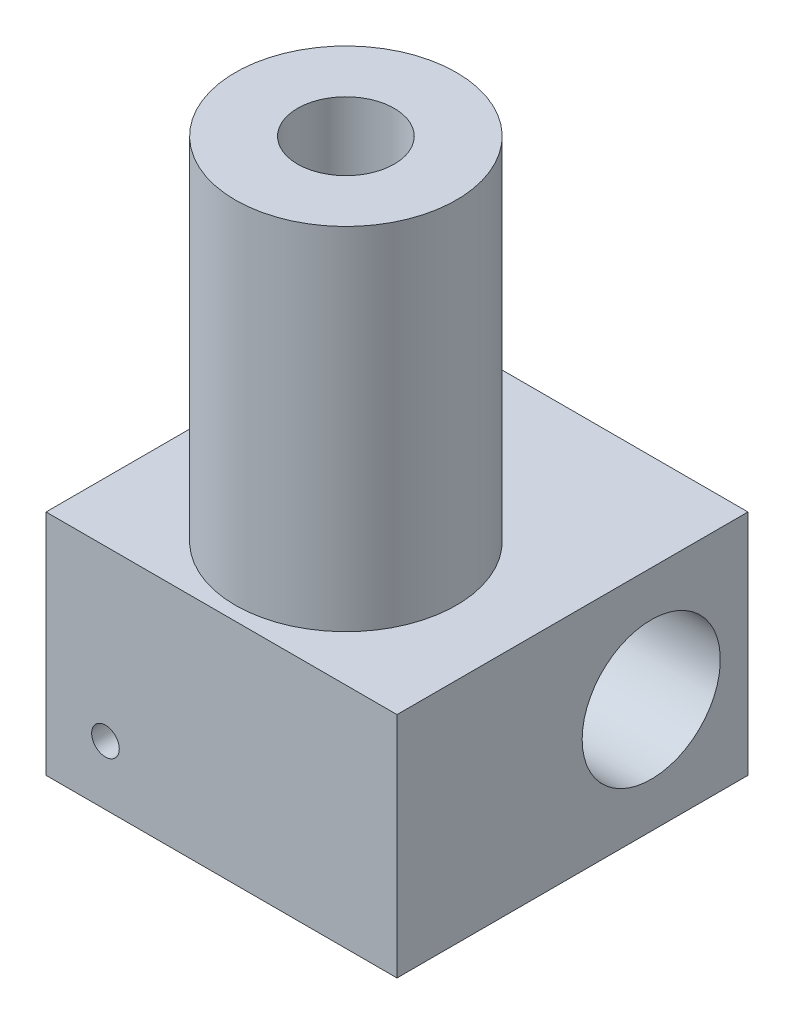
ISO-10303-21;
HEADER;
FILE_DESCRIPTION(('STEP AP214'),'2;1');
FILE_NAME('part.step','',(''),(''),'','','');
FILE_SCHEMA(('AUTOMOTIVE_DESIGN { 1 0 10303 214 1 1 1 1 }'));
ENDSEC;
DATA;
#1=APPLICATION_CONTEXT('core data for automotive mechanical design processes');
#2=APPLICATION_PROTOCOL_DEFINITION('international standard','automotive_design',2000,#1);
#3=PRODUCT_CONTEXT('',#1,'mechanical');
#4=PRODUCT('Part','Part','',(#3));
#5=PRODUCT_RELATED_PRODUCT_CATEGORY('part','',(#4));
#6=PRODUCT_DEFINITION_FORMATION('','',#4);
#7=PRODUCT_DEFINITION_CONTEXT('part definition',#1,'design');
#8=PRODUCT_DEFINITION('design','',#6,#7);
#9=PRODUCT_DEFINITION_SHAPE('','',#8);
#10=(LENGTH_UNIT() NAMED_UNIT(*) SI_UNIT(.MILLI.,.METRE.));
#11=(NAMED_UNIT(*) PLANE_ANGLE_UNIT() SI_UNIT($,.RADIAN.));
#12=(NAMED_UNIT(*) SI_UNIT($,.STERADIAN.) SOLID_ANGLE_UNIT());
#13=UNCERTAINTY_MEASURE_WITH_UNIT(LENGTH_MEASURE(1.E-05),#10,'distance_accuracy_value','');
#14=(GEOMETRIC_REPRESENTATION_CONTEXT(3) GLOBAL_UNCERTAINTY_ASSIGNED_CONTEXT((#13)) GLOBAL_UNIT_ASSIGNED_CONTEXT((#10,
#11,#12)) REPRESENTATION_CONTEXT('',''));
#15=CARTESIAN_POINT('',(0.,0.,0.));
#16=DIRECTION('',(0.,0.,1.));
#17=DIRECTION('',(1.,0.,0.));
#18=AXIS2_PLACEMENT_3D('',#15,#16,#17);
#19=CARTESIAN_POINT('',(-6.35,0.,6.35));
#20=DIRECTION('',(0.,1.,0.));
#21=DIRECTION('',(0.,0.,1.));
#22=AXIS2_PLACEMENT_3D('',#19,#20,#21);
#23=PLANE('',#22);
#24=DIRECTION('',(0.,0.,1.));
#25=VECTOR('',#24,1.);
#26=CARTESIAN_POINT('',(-6.35,0.,-6.35));
#27=LINE('',#26,#25);
#28=CARTESIAN_POINT('',(-6.35,0.,-6.35));
#29=VERTEX_POINT('',#28);
#30=CARTESIAN_POINT('',(-6.35,0.,6.35));
#31=VERTEX_POINT('',#30);
#32=EDGE_CURVE('E101',#29,#31,#27,.T.);
#33=ORIENTED_EDGE('',*,*,#32,.F.);
#34=DIRECTION('',(-1.,0.,0.));
#35=VECTOR('',#34,1.);
#36=CARTESIAN_POINT('',(-6.35,0.,-6.35));
#37=LINE('',#36,#35);
#38=CARTESIAN_POINT('',(6.35,0.,-6.35));
#39=VERTEX_POINT('',#38);
#40=EDGE_CURVE('E73',#39,#29,#37,.T.);
#41=ORIENTED_EDGE('',*,*,#40,.F.);
#42=DIRECTION('',(0.,0.,-1.));
#43=VECTOR('',#42,1.);
#44=CARTESIAN_POINT('',(6.35,0.,-6.35));
#45=LINE('',#44,#43);
#46=CARTESIAN_POINT('',(6.35,0.,6.35));
#47=VERTEX_POINT('',#46);
#48=EDGE_CURVE('E67',#47,#39,#45,.T.);
#49=ORIENTED_EDGE('',*,*,#48,.F.);
#50=DIRECTION('',(1.,0.,0.));
#51=VECTOR('',#50,1.);
#52=CARTESIAN_POINT('',(-6.35,0.,6.35));
#53=LINE('',#52,#51);
#54=EDGE_CURVE('E92',#31,#47,#53,.T.);
#55=ORIENTED_EDGE('',*,*,#54,.F.);
#56=EDGE_LOOP('',(#33,#41,#49,#55));
#57=FACE_BOUND('',#56,.T.);
#58=CARTESIAN_POINT('',(0.,0.,1.85));
#59=DIRECTION('',(0.,1.,0.));
#60=DIRECTION('',(0.,0.,1.));
#61=AXIS2_PLACEMENT_3D('',#58,#59,#60);
#62=CIRCLE('',#61,4.);
#63=CARTESIAN_POINT('',(0.,0.,5.85));
#64=VERTEX_POINT('',#63);
#65=EDGE_CURVE('E11',#64,#64,#62,.F.);
#66=ORIENTED_EDGE('',*,*,#65,.F.);
#67=EDGE_LOOP('',(#66));
#68=FACE_BOUND('',#67,.T.);
#69=ADVANCED_FACE('F33',(#57,#68),#23,.F.);
#70=CARTESIAN_POINT('',(-6.35,8.255,6.35));
#71=DIRECTION('',(0.,1.,0.));
#72=DIRECTION('',(0.,0.,1.));
#73=AXIS2_PLACEMENT_3D('',#70,#71,#72);
#74=PLANE('',#73);
#75=DIRECTION('',(0.,0.,1.));
#76=VECTOR('',#75,1.);
#77=CARTESIAN_POINT('',(-6.35,8.255,-6.35));
#78=LINE('',#77,#76);
#79=CARTESIAN_POINT('',(-6.35,8.255,-6.35));
#80=VERTEX_POINT('',#79);
#81=CARTESIAN_POINT('',(-6.35,8.255,6.35));
#82=VERTEX_POINT('',#81);
#83=EDGE_CURVE('E87',#80,#82,#78,.T.);
#84=ORIENTED_EDGE('',*,*,#83,.T.);
#85=DIRECTION('',(1.,0.,0.));
#86=VECTOR('',#85,1.);
#87=CARTESIAN_POINT('',(-6.35,8.255,6.35));
#88=LINE('',#87,#86);
#89=CARTESIAN_POINT('',(6.35,8.255,6.35));
#90=VERTEX_POINT('',#89);
#91=EDGE_CURVE('E81',#82,#90,#88,.T.);
#92=ORIENTED_EDGE('',*,*,#91,.T.);
#93=DIRECTION('',(0.,0.,-1.));
#94=VECTOR('',#93,1.);
#95=CARTESIAN_POINT('',(6.35,8.255,-6.35));
#96=LINE('',#95,#94);
#97=CARTESIAN_POINT('',(6.35,8.255,-6.35));
#98=VERTEX_POINT('',#97);
#99=EDGE_CURVE('E85',#90,#98,#96,.T.);
#100=ORIENTED_EDGE('',*,*,#99,.T.);
#101=DIRECTION('',(-1.,0.,0.));
#102=VECTOR('',#101,1.);
#103=CARTESIAN_POINT('',(-6.35,8.255,-6.35));
#104=LINE('',#103,#102);
#105=EDGE_CURVE('E50',#98,#80,#104,.T.);
#106=ORIENTED_EDGE('',*,*,#105,.T.);
#107=EDGE_LOOP('',(#84,#92,#100,#106));
#108=FACE_BOUND('',#107,.T.);
#109=CARTESIAN_POINT('',(0.,8.255,1.85));
#110=DIRECTION('',(0.,1.,0.));
#111=DIRECTION('',(0.,0.,1.));
#112=AXIS2_PLACEMENT_3D('',#109,#110,#111);
#113=CIRCLE('',#112,4.);
#114=CARTESIAN_POINT('',(0.,8.255,5.85));
#115=VERTEX_POINT('',#114);
#116=EDGE_CURVE('E182',#115,#115,#113,.T.);
#117=ORIENTED_EDGE('',*,*,#116,.F.);
#118=EDGE_LOOP('',(#117));
#119=FACE_BOUND('',#118,.T.);
#120=ADVANCED_FACE('F82',(#108,#119),#74,.T.);
#121=CARTESIAN_POINT('',(-6.35,8.255,-6.35));
#122=DIRECTION('',(1.,0.,0.));
#123=DIRECTION('',(0.,0.,-1.));
#124=AXIS2_PLACEMENT_3D('',#121,#122,#123);
#125=PLANE('',#124);
#126=CARTESIAN_POINT('',(-6.35,4.1275,-2.85));
#127=DIRECTION('',(-1.,0.,0.));
#128=DIRECTION('',(0.,0.,1.));
#129=AXIS2_PLACEMENT_3D('',#126,#127,#128);
#130=CIRCLE('',#129,2.5);
#131=CARTESIAN_POINT('',(-6.35,4.1275,-0.349999999999998));
#132=VERTEX_POINT('',#131);
#133=EDGE_CURVE('E159',#132,#132,#130,.T.);
#134=ORIENTED_EDGE('',*,*,#133,.F.);
#135=EDGE_LOOP('',(#134));
#136=FACE_BOUND('',#135,.T.);
#137=ORIENTED_EDGE('',*,*,#32,.T.);
#138=DIRECTION('',(0.,-1.,0.));
#139=VECTOR('',#138,1.);
#140=CARTESIAN_POINT('',(-6.35,8.255,6.35));
#141=LINE('',#140,#139);
#142=EDGE_CURVE('E42',#82,#31,#141,.T.);
#143=ORIENTED_EDGE('',*,*,#142,.F.);
#144=ORIENTED_EDGE('',*,*,#83,.F.);
#145=DIRECTION('',(0.,-1.,0.));
#146=VECTOR('',#145,1.);
#147=CARTESIAN_POINT('',(-6.35,8.255,-6.35));
#148=LINE('',#147,#146);
#149=EDGE_CURVE('E97',#80,#29,#148,.T.);
#150=ORIENTED_EDGE('',*,*,#149,.T.);
#151=EDGE_LOOP('',(#137,#143,#144,#150));
#152=FACE_BOUND('',#151,.T.);
#153=ADVANCED_FACE('F35',(#136,#152),#125,.F.);
#154=CARTESIAN_POINT('',(-6.35,8.255,6.35));
#155=DIRECTION('',(0.,0.,-1.));
#156=DIRECTION('',(-1.,0.,0.));
#157=AXIS2_PLACEMENT_3D('',#154,#155,#156);
#158=PLANE('',#157);
#159=CARTESIAN_POINT('',(-4.1999146449155,2.15008535508451,6.35));
#160=DIRECTION('',(0.,0.,1.));
#161=DIRECTION('',(1.,0.,0.));
#162=AXIS2_PLACEMENT_3D('',#159,#160,#161);
#163=CIRCLE('',#162,0.5);
#164=CARTESIAN_POINT('',(-3.6999146449155,2.15008535508451,6.35));
#165=VERTEX_POINT('',#164);
#166=EDGE_CURVE('E154',#165,#165,#163,.T.);
#167=ORIENTED_EDGE('',*,*,#166,.F.);
#168=EDGE_LOOP('',(#167));
#169=FACE_BOUND('',#168,.T.);
#170=ORIENTED_EDGE('',*,*,#54,.T.);
#171=DIRECTION('',(0.,-1.,0.));
#172=VECTOR('',#171,1.);
#173=CARTESIAN_POINT('',(6.35,8.255,6.35));
#174=LINE('',#173,#172);
#175=EDGE_CURVE('E90',#90,#47,#174,.T.);
#176=ORIENTED_EDGE('',*,*,#175,.F.);
#177=ORIENTED_EDGE('',*,*,#91,.F.);
#178=ORIENTED_EDGE('',*,*,#142,.T.);
#179=EDGE_LOOP('',(#170,#176,#177,#178));
#180=FACE_BOUND('',#179,.T.);
#181=ADVANCED_FACE('F91',(#169,#180),#158,.F.);
#182=CARTESIAN_POINT('',(6.35,8.255,-6.35));
#183=DIRECTION('',(-1.,0.,0.));
#184=DIRECTION('',(0.,0.,1.));
#185=AXIS2_PLACEMENT_3D('',#182,#183,#184);
#186=PLANE('',#185);
#187=CARTESIAN_POINT('',(6.35,4.1275,-2.85));
#188=DIRECTION('',(-1.,0.,0.));
#189=DIRECTION('',(0.,0.,1.));
#190=AXIS2_PLACEMENT_3D('',#187,#188,#189);
#191=CIRCLE('',#190,2.5);
#192=CARTESIAN_POINT('',(6.35,4.1275,-0.349999999999999));
#193=VERTEX_POINT('',#192);
#194=EDGE_CURVE('E164',#193,#193,#191,.F.);
#195=ORIENTED_EDGE('',*,*,#194,.F.);
#196=EDGE_LOOP('',(#195));
#197=FACE_BOUND('',#196,.T.);
#198=ORIENTED_EDGE('',*,*,#48,.T.);
#199=DIRECTION('',(0.,-1.,0.));
#200=VECTOR('',#199,1.);
#201=CARTESIAN_POINT('',(6.35,8.255,-6.35));
#202=LINE('',#201,#200);
#203=EDGE_CURVE('E93',#98,#39,#202,.T.);
#204=ORIENTED_EDGE('',*,*,#203,.F.);
#205=ORIENTED_EDGE('',*,*,#99,.F.);
#206=ORIENTED_EDGE('',*,*,#175,.T.);
#207=EDGE_LOOP('',(#198,#204,#205,#206));
#208=FACE_BOUND('',#207,.T.);
#209=ADVANCED_FACE('F95',(#197,#208),#186,.F.);
#210=CARTESIAN_POINT('',(-6.35,8.255,-6.35));
#211=DIRECTION('',(0.,0.,1.));
#212=DIRECTION('',(1.,0.,0.));
#213=AXIS2_PLACEMENT_3D('',#210,#211,#212);
#214=PLANE('',#213);
#215=ORIENTED_EDGE('',*,*,#40,.T.);
#216=ORIENTED_EDGE('',*,*,#149,.F.);
#217=ORIENTED_EDGE('',*,*,#105,.F.);
#218=ORIENTED_EDGE('',*,*,#203,.T.);
#219=EDGE_LOOP('',(#215,#216,#217,#218));
#220=FACE_BOUND('',#219,.T.);
#221=ADVANCED_FACE('F138',(#220),#214,.F.);
#222=CARTESIAN_POINT('',(0.,20.955,1.85));
#223=DIRECTION('',(0.,-1.,0.));
#224=DIRECTION('',(0.,0.,-1.));
#225=AXIS2_PLACEMENT_3D('',#222,#223,#224);
#226=CYLINDRICAL_SURFACE('',#225,4.);
#227=CARTESIAN_POINT('',(0.,20.955,1.85));
#228=DIRECTION('',(0.,1.,0.));
#229=DIRECTION('',(0.,0.,1.));
#230=AXIS2_PLACEMENT_3D('',#227,#228,#229);
#231=CIRCLE('',#230,4.);
#232=CARTESIAN_POINT('',(0.,20.955,5.85));
#233=VERTEX_POINT('',#232);
#234=EDGE_CURVE('E104',#233,#233,#231,.T.);
#235=ORIENTED_EDGE('',*,*,#234,.F.);
#236=EDGE_LOOP('',(#235));
#237=FACE_BOUND('',#236,.T.);
#238=ORIENTED_EDGE('',*,*,#116,.T.);
#239=EDGE_LOOP('',(#238));
#240=FACE_BOUND('',#239,.T.);
#241=ADVANCED_FACE('F130',(#237,#240),#226,.T.);
#242=CARTESIAN_POINT('',(0.,20.955,1.85));
#243=DIRECTION('',(0.,1.,0.));
#244=DIRECTION('',(0.,0.,1.));
#245=AXIS2_PLACEMENT_3D('',#242,#243,#244);
#246=PLANE('',#245);
#247=CARTESIAN_POINT('',(0.,20.955,1.85));
#248=DIRECTION('',(0.,1.,0.));
#249=DIRECTION('',(0.,0.,1.));
#250=AXIS2_PLACEMENT_3D('',#247,#248,#249);
#251=CIRCLE('',#250,1.75);
#252=CARTESIAN_POINT('',(0.,20.955,3.6));
#253=VERTEX_POINT('',#252);
#254=EDGE_CURVE('E167',#253,#253,#251,.T.);
#255=ORIENTED_EDGE('',*,*,#254,.F.);
#256=EDGE_LOOP('',(#255));
#257=FACE_BOUND('',#256,.T.);
#258=ORIENTED_EDGE('',*,*,#234,.T.);
#259=EDGE_LOOP('',(#258));
#260=FACE_BOUND('',#259,.T.);
#261=ADVANCED_FACE('F120',(#257,#260),#246,.T.);
#262=CARTESIAN_POINT('',(0.,0.,1.85));
#263=DIRECTION('',(0.,1.,0.));
#264=DIRECTION('',(0.,0.,-1.));
#265=AXIS2_PLACEMENT_3D('',#262,#263,#264);
#266=CONICAL_SURFACE('',#265,4.,0.89011791851711);
#267=CARTESIAN_POINT('',(0.,-2.5,1.85));
#268=DIRECTION('',(0.,-1.,0.));
#269=DIRECTION('',(0.,0.,-1.));
#270=AXIS2_PLACEMENT_3D('',#267,#268,#269);
#271=CIRCLE('',#270,0.91275710866236);
#272=CARTESIAN_POINT('',(0.,-2.5,0.93724289133764));
#273=VERTEX_POINT('',#272);
#274=EDGE_CURVE('E179',#273,#273,#271,.T.);
#275=ORIENTED_EDGE('',*,*,#274,.F.);
#276=EDGE_LOOP('',(#275));
#277=FACE_BOUND('',#276,.T.);
#278=ORIENTED_EDGE('',*,*,#65,.T.);
#279=EDGE_LOOP('',(#278));
#280=FACE_BOUND('',#279,.T.);
#281=ADVANCED_FACE('F117',(#277,#280),#266,.T.);
#282=CARTESIAN_POINT('',(0.,-2.5,-14.1114213562373));
#283=DIRECTION('',(0.,-1.,0.));
#284=DIRECTION('',(0.,0.,-1.));
#285=AXIS2_PLACEMENT_3D('',#282,#283,#284);
#286=PLANE('',#285);
#287=CARTESIAN_POINT('',(0.,-2.5,1.85));
#288=DIRECTION('',(0.,-1.,0.));
#289=DIRECTION('',(0.,0.,-1.));
#290=AXIS2_PLACEMENT_3D('',#287,#288,#289);
#291=CIRCLE('',#290,0.25);
#292=CARTESIAN_POINT('',(0.,-2.5,1.6));
#293=VERTEX_POINT('',#292);
#294=EDGE_CURVE('E176',#293,#293,#291,.T.);
#295=ORIENTED_EDGE('',*,*,#294,.F.);
#296=EDGE_LOOP('',(#295));
#297=FACE_BOUND('',#296,.T.);
#298=ORIENTED_EDGE('',*,*,#274,.T.);
#299=EDGE_LOOP('',(#298));
#300=FACE_BOUND('',#299,.T.);
#301=ADVANCED_FACE('F119',(#297,#300),#286,.T.);
#302=CARTESIAN_POINT('',(0.,0.,1.85));
#303=DIRECTION('',(0.,-1.,0.));
#304=DIRECTION('',(0.,0.,-1.));
#305=AXIS2_PLACEMENT_3D('',#302,#303,#304);
#306=CYLINDRICAL_SURFACE('',#305,0.25);
#307=CARTESIAN_POINT('',(0.,0.,1.85));
#308=DIRECTION('',(0.,1.,0.));
#309=DIRECTION('',(0.,0.,1.));
#310=AXIS2_PLACEMENT_3D('',#307,#308,#309);
#311=CIRCLE('',#310,0.25);
#312=CARTESIAN_POINT('',(0.,0.,2.1));
#313=VERTEX_POINT('',#312);
#314=EDGE_CURVE('E171',#313,#313,#311,.F.);
#315=ORIENTED_EDGE('',*,*,#314,.F.);
#316=EDGE_LOOP('',(#315));
#317=FACE_BOUND('',#316,.T.);
#318=ORIENTED_EDGE('',*,*,#294,.T.);
#319=EDGE_LOOP('',(#318));
#320=FACE_BOUND('',#319,.T.);
#321=ADVANCED_FACE('F127',(#317,#320),#306,.F.);
#322=CARTESIAN_POINT('',(0.,0.,1.85));
#323=DIRECTION('',(0.,1.,0.));
#324=DIRECTION('',(0.,0.,1.));
#325=AXIS2_PLACEMENT_3D('',#322,#323,#324);
#326=PLANE('',#325);
#327=CARTESIAN_POINT('',(0.,0.,1.85));
#328=DIRECTION('',(0.,1.,0.));
#329=DIRECTION('',(0.,0.,1.));
#330=AXIS2_PLACEMENT_3D('',#327,#328,#329);
#331=CIRCLE('',#330,1.75);
#332=CARTESIAN_POINT('',(0.,0.,3.6));
#333=VERTEX_POINT('',#332);
#334=EDGE_CURVE('E168',#333,#333,#331,.T.);
#335=ORIENTED_EDGE('',*,*,#334,.T.);
#336=EDGE_LOOP('',(#335));
#337=FACE_BOUND('',#336,.T.);
#338=ORIENTED_EDGE('',*,*,#314,.T.);
#339=EDGE_LOOP('',(#338));
#340=FACE_BOUND('',#339,.T.);
#341=ADVANCED_FACE('F194',(#337,#340),#326,.T.);
#342=CARTESIAN_POINT('',(0.,0.,1.85));
#343=DIRECTION('',(0.,1.,0.));
#344=DIRECTION('',(0.,0.,1.));
#345=AXIS2_PLACEMENT_3D('',#342,#343,#344);
#346=CYLINDRICAL_SURFACE('',#345,1.75);
#347=ORIENTED_EDGE('',*,*,#334,.F.);
#348=EDGE_LOOP('',(#347));
#349=FACE_BOUND('',#348,.T.);
#350=ORIENTED_EDGE('',*,*,#254,.T.);
#351=EDGE_LOOP('',(#350));
#352=FACE_BOUND('',#351,.T.);
#353=ADVANCED_FACE('F199',(#349,#352),#346,.F.);
#354=CARTESIAN_POINT('',(13.4210678118655,4.1275,-2.85));
#355=DIRECTION('',(-1.,0.,0.));
#356=DIRECTION('',(0.,0.,1.));
#357=AXIS2_PLACEMENT_3D('',#354,#355,#356);
#358=CYLINDRICAL_SURFACE('',#357,2.5);
#359=ORIENTED_EDGE('',*,*,#194,.T.);
#360=EDGE_LOOP('',(#359));
#361=FACE_BOUND('',#360,.T.);
#362=ORIENTED_EDGE('',*,*,#133,.T.);
#363=EDGE_LOOP('',(#362));
#364=FACE_BOUND('',#363,.T.);
#365=ADVANCED_FACE('F205',(#361,#364),#358,.F.);
#366=CARTESIAN_POINT('',(-4.1999146449155,2.15008535508451,3.85));
#367=DIRECTION('',(0.,0.,1.));
#368=DIRECTION('',(1.,0.,0.));
#369=AXIS2_PLACEMENT_3D('',#366,#367,#368);
#370=CYLINDRICAL_SURFACE('',#369,0.5);
#371=CARTESIAN_POINT('',(-4.1999146449155,2.15008535508451,3.85));
#372=DIRECTION('',(0.,0.,1.));
#373=DIRECTION('',(1.,0.,0.));
#374=AXIS2_PLACEMENT_3D('',#371,#372,#373);
#375=CIRCLE('',#374,0.5);
#376=CARTESIAN_POINT('',(-3.6999146449155,2.15008535508451,3.85));
#377=VERTEX_POINT('',#376);
#378=EDGE_CURVE('E156',#377,#377,#375,.T.);
#379=ORIENTED_EDGE('',*,*,#378,.F.);
#380=EDGE_LOOP('',(#379));
#381=FACE_BOUND('',#380,.T.);
#382=ORIENTED_EDGE('',*,*,#166,.T.);
#383=EDGE_LOOP('',(#382));
#384=FACE_BOUND('',#383,.T.);
#385=ADVANCED_FACE('F210',(#381,#384),#370,.F.);
#386=CARTESIAN_POINT('',(-4.1999146449155,2.15008535508451,3.85));
#387=DIRECTION('',(0.,0.,1.));
#388=DIRECTION('',(1.,0.,0.));
#389=AXIS2_PLACEMENT_3D('',#386,#387,#388);
#390=PLANE('',#389);
#391=ORIENTED_EDGE('',*,*,#378,.T.);
#392=EDGE_LOOP('',(#391));
#393=FACE_BOUND('',#392,.T.);
#394=ADVANCED_FACE('F214',(#393),#390,.T.);
#395=CLOSED_SHELL('',(#69,#120,#153,#181,#209,#221,#241,#261,#281,#301,#321,#341,#353,#365,#385,#394));
#396=MANIFOLD_SOLID_BREP('B2',#395);
#397=ADVANCED_BREP_SHAPE_REPRESENTATION('',(#18,#396),#14);
#398=SHAPE_DEFINITION_REPRESENTATION(#9,#397);
ENDSEC;
END-ISO-10303-21;
